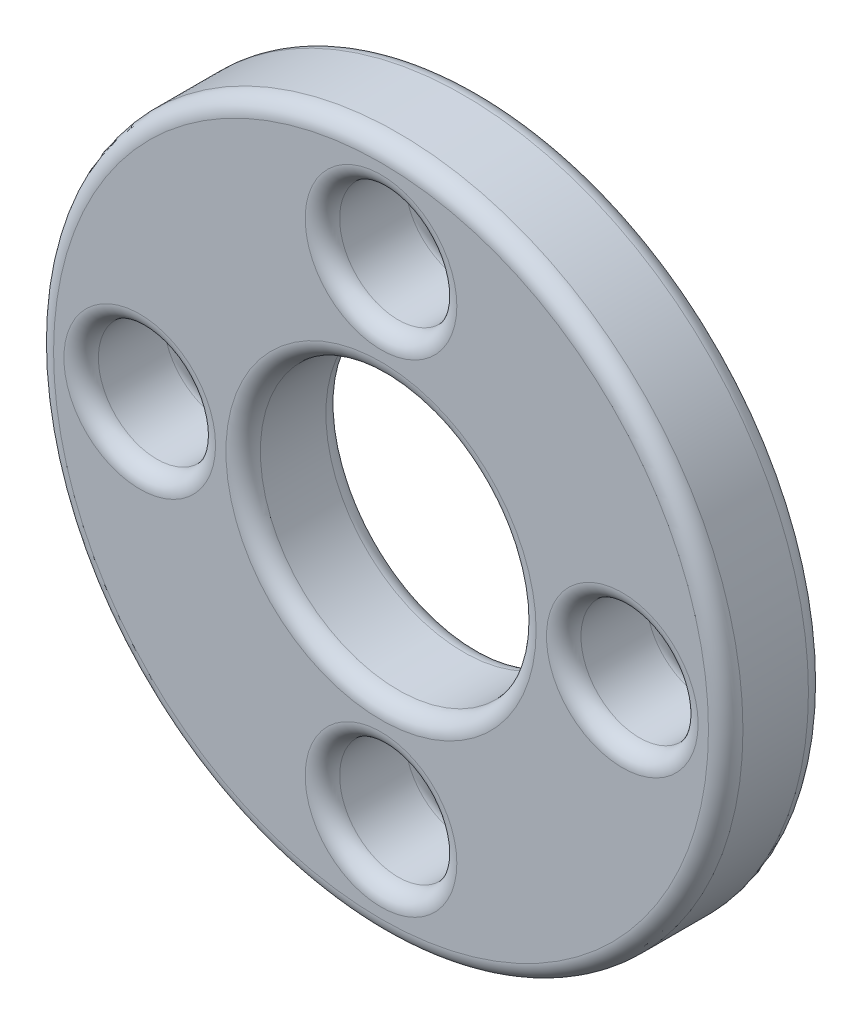
ISO-10303-21;
HEADER;
FILE_DESCRIPTION(('STEP AP214'),'2;1');
FILE_NAME('part.step','',(''),(''),'','','');
FILE_SCHEMA(('AUTOMOTIVE_DESIGN { 1 0 10303 214 1 1 1 1 }'));
ENDSEC;
DATA;
#1=APPLICATION_CONTEXT('core data for automotive mechanical design processes');
#2=APPLICATION_PROTOCOL_DEFINITION('international standard','automotive_design',2000,#1);
#3=PRODUCT_CONTEXT('',#1,'mechanical');
#4=PRODUCT('Part','Part','',(#3));
#5=PRODUCT_RELATED_PRODUCT_CATEGORY('part','',(#4));
#6=PRODUCT_DEFINITION_FORMATION('','',#4);
#7=PRODUCT_DEFINITION_CONTEXT('part definition',#1,'design');
#8=PRODUCT_DEFINITION('design','',#6,#7);
#9=PRODUCT_DEFINITION_SHAPE('','',#8);
#10=(LENGTH_UNIT() NAMED_UNIT(*) SI_UNIT(.MILLI.,.METRE.));
#11=(NAMED_UNIT(*) PLANE_ANGLE_UNIT() SI_UNIT($,.RADIAN.));
#12=(NAMED_UNIT(*) SI_UNIT($,.STERADIAN.) SOLID_ANGLE_UNIT());
#13=UNCERTAINTY_MEASURE_WITH_UNIT(LENGTH_MEASURE(1.E-05),#10,'distance_accuracy_value','');
#14=(GEOMETRIC_REPRESENTATION_CONTEXT(3) GLOBAL_UNCERTAINTY_ASSIGNED_CONTEXT((#13)) GLOBAL_UNIT_ASSIGNED_CONTEXT((#10,
#11,#12)) REPRESENTATION_CONTEXT('',''));
#15=CARTESIAN_POINT('',(0.,0.,0.));
#16=DIRECTION('',(0.,0.,1.));
#17=DIRECTION('',(1.,0.,0.));
#18=AXIS2_PLACEMENT_3D('',#15,#16,#17);
#19=CARTESIAN_POINT('',(0.,0.,2.9));
#20=DIRECTION('',(0.,0.,-1.));
#21=DIRECTION('',(-1.,0.,0.));
#22=AXIS2_PLACEMENT_3D('',#19,#20,#21);
#23=CYLINDRICAL_SURFACE('',#22,10.);
#24=CARTESIAN_POINT('',(0.,0.,0.5));
#25=DIRECTION('',(0.,0.,1.));
#26=DIRECTION('',(1.,0.,0.));
#27=AXIS2_PLACEMENT_3D('',#24,#25,#26);
#28=CIRCLE('',#27,10.);
#29=CARTESIAN_POINT('',(10.,0.,0.5));
#30=VERTEX_POINT('',#29);
#31=EDGE_CURVE('E115',#30,#30,#28,.T.);
#32=ORIENTED_EDGE('',*,*,#31,.T.);
#33=EDGE_LOOP('',(#32));
#34=FACE_BOUND('',#33,.T.);
#35=CARTESIAN_POINT('',(0.,0.,2.4));
#36=DIRECTION('',(0.,0.,1.));
#37=DIRECTION('',(1.,0.,0.));
#38=AXIS2_PLACEMENT_3D('',#35,#36,#37);
#39=CIRCLE('',#38,10.);
#40=CARTESIAN_POINT('',(10.,0.,2.4));
#41=VERTEX_POINT('',#40);
#42=EDGE_CURVE('E118',#41,#41,#39,.F.);
#43=ORIENTED_EDGE('',*,*,#42,.T.);
#44=EDGE_LOOP('',(#43));
#45=FACE_BOUND('',#44,.T.);
#46=ADVANCED_FACE('F41',(#34,#45),#23,.T.);
#47=CARTESIAN_POINT('',(0.,0.,2.9));
#48=DIRECTION('',(0.,0.,1.));
#49=DIRECTION('',(1.,0.,0.));
#50=AXIS2_PLACEMENT_3D('',#47,#48,#49);
#51=PLANE('',#50);
#52=CARTESIAN_POINT('',(0.,0.,2.9));
#53=DIRECTION('',(0.,0.,1.));
#54=DIRECTION('',(1.,0.,0.));
#55=AXIS2_PLACEMENT_3D('',#52,#53,#54);
#56=CIRCLE('',#55,9.5);
#57=CARTESIAN_POINT('',(9.5,0.,2.9));
#58=VERTEX_POINT('',#57);
#59=EDGE_CURVE('E10',#58,#58,#56,.T.);
#60=ORIENTED_EDGE('',*,*,#59,.T.);
#61=EDGE_LOOP('',(#60));
#62=FACE_BOUND('',#61,.T.);
#63=CARTESIAN_POINT('',(7.,0.,2.9));
#64=DIRECTION('',(0.,0.,1.));
#65=DIRECTION('',(1.,0.,0.));
#66=AXIS2_PLACEMENT_3D('',#63,#64,#65);
#67=CIRCLE('',#66,2.2);
#68=CARTESIAN_POINT('',(9.2,0.,2.9));
#69=VERTEX_POINT('',#68);
#70=EDGE_CURVE('E48',#69,#69,#67,.F.);
#71=ORIENTED_EDGE('',*,*,#70,.T.);
#72=EDGE_LOOP('',(#71));
#73=FACE_BOUND('',#72,.T.);
#74=CARTESIAN_POINT('',(0.,-7.,2.9));
#75=DIRECTION('',(0.,0.,1.));
#76=DIRECTION('',(1.,0.,0.));
#77=AXIS2_PLACEMENT_3D('',#74,#75,#76);
#78=CIRCLE('',#77,2.2);
#79=CARTESIAN_POINT('',(2.2,-7.,2.9));
#80=VERTEX_POINT('',#79);
#81=EDGE_CURVE('E52',#80,#80,#78,.F.);
#82=ORIENTED_EDGE('',*,*,#81,.T.);
#83=EDGE_LOOP('',(#82));
#84=FACE_BOUND('',#83,.T.);
#85=CARTESIAN_POINT('',(-7.,0.,2.9));
#86=DIRECTION('',(0.,0.,1.));
#87=DIRECTION('',(1.,0.,0.));
#88=AXIS2_PLACEMENT_3D('',#85,#86,#87);
#89=CIRCLE('',#88,2.2);
#90=CARTESIAN_POINT('',(-4.8,0.,2.9));
#91=VERTEX_POINT('',#90);
#92=EDGE_CURVE('E56',#91,#91,#89,.F.);
#93=ORIENTED_EDGE('',*,*,#92,.T.);
#94=EDGE_LOOP('',(#93));
#95=FACE_BOUND('',#94,.T.);
#96=CARTESIAN_POINT('',(0.,7.,2.9));
#97=DIRECTION('',(0.,0.,1.));
#98=DIRECTION('',(1.,0.,0.));
#99=AXIS2_PLACEMENT_3D('',#96,#97,#98);
#100=CIRCLE('',#99,2.2);
#101=CARTESIAN_POINT('',(2.2,7.,2.9));
#102=VERTEX_POINT('',#101);
#103=EDGE_CURVE('E61',#102,#102,#100,.F.);
#104=ORIENTED_EDGE('',*,*,#103,.T.);
#105=EDGE_LOOP('',(#104));
#106=FACE_BOUND('',#105,.T.);
#107=CARTESIAN_POINT('',(0.,0.,2.9));
#108=DIRECTION('',(0.,0.,1.));
#109=DIRECTION('',(1.,0.,0.));
#110=AXIS2_PLACEMENT_3D('',#107,#108,#109);
#111=CIRCLE('',#110,4.5);
#112=CARTESIAN_POINT('',(4.5,0.,2.9));
#113=VERTEX_POINT('',#112);
#114=EDGE_CURVE('E64',#113,#113,#111,.F.);
#115=ORIENTED_EDGE('',*,*,#114,.T.);
#116=EDGE_LOOP('',(#115));
#117=FACE_BOUND('',#116,.T.);
#118=ADVANCED_FACE('F140',(#62,#73,#84,#95,#106,#117),#51,.T.);
#119=CARTESIAN_POINT('',(0.,0.,0.));
#120=DIRECTION('',(0.,0.,1.));
#121=DIRECTION('',(1.,0.,0.));
#122=AXIS2_PLACEMENT_3D('',#119,#120,#121);
#123=PLANE('',#122);
#124=CARTESIAN_POINT('',(0.,0.,0.));
#125=DIRECTION('',(0.,0.,1.));
#126=DIRECTION('',(1.,0.,0.));
#127=AXIS2_PLACEMENT_3D('',#124,#125,#126);
#128=CIRCLE('',#127,9.5);
#129=CARTESIAN_POINT('',(9.5,0.,0.));
#130=VERTEX_POINT('',#129);
#131=EDGE_CURVE('E97',#130,#130,#128,.F.);
#132=ORIENTED_EDGE('',*,*,#131,.T.);
#133=EDGE_LOOP('',(#132));
#134=FACE_BOUND('',#133,.T.);
#135=CARTESIAN_POINT('',(7.,0.,0.));
#136=DIRECTION('',(0.,0.,1.));
#137=DIRECTION('',(1.,0.,0.));
#138=AXIS2_PLACEMENT_3D('',#135,#136,#137);
#139=CIRCLE('',#138,2.2);
#140=CARTESIAN_POINT('',(9.2,0.,0.));
#141=VERTEX_POINT('',#140);
#142=EDGE_CURVE('E100',#141,#141,#139,.T.);
#143=ORIENTED_EDGE('',*,*,#142,.T.);
#144=EDGE_LOOP('',(#143));
#145=FACE_BOUND('',#144,.T.);
#146=CARTESIAN_POINT('',(0.,-7.,0.));
#147=DIRECTION('',(0.,0.,1.));
#148=DIRECTION('',(1.,0.,0.));
#149=AXIS2_PLACEMENT_3D('',#146,#147,#148);
#150=CIRCLE('',#149,2.2);
#151=CARTESIAN_POINT('',(2.2,-7.,0.));
#152=VERTEX_POINT('',#151);
#153=EDGE_CURVE('E103',#152,#152,#150,.T.);
#154=ORIENTED_EDGE('',*,*,#153,.T.);
#155=EDGE_LOOP('',(#154));
#156=FACE_BOUND('',#155,.T.);
#157=CARTESIAN_POINT('',(-7.,0.,0.));
#158=DIRECTION('',(0.,0.,1.));
#159=DIRECTION('',(1.,0.,0.));
#160=AXIS2_PLACEMENT_3D('',#157,#158,#159);
#161=CIRCLE('',#160,2.2);
#162=CARTESIAN_POINT('',(-4.8,0.,0.));
#163=VERTEX_POINT('',#162);
#164=EDGE_CURVE('E106',#163,#163,#161,.T.);
#165=ORIENTED_EDGE('',*,*,#164,.T.);
#166=EDGE_LOOP('',(#165));
#167=FACE_BOUND('',#166,.T.);
#168=CARTESIAN_POINT('',(0.,7.,0.));
#169=DIRECTION('',(0.,0.,1.));
#170=DIRECTION('',(1.,0.,0.));
#171=AXIS2_PLACEMENT_3D('',#168,#169,#170);
#172=CIRCLE('',#171,2.2);
#173=CARTESIAN_POINT('',(2.2,7.,0.));
#174=VERTEX_POINT('',#173);
#175=EDGE_CURVE('E109',#174,#174,#172,.T.);
#176=ORIENTED_EDGE('',*,*,#175,.T.);
#177=EDGE_LOOP('',(#176));
#178=FACE_BOUND('',#177,.T.);
#179=CARTESIAN_POINT('',(0.,0.,0.));
#180=DIRECTION('',(0.,0.,1.));
#181=DIRECTION('',(1.,0.,0.));
#182=AXIS2_PLACEMENT_3D('',#179,#180,#181);
#183=CIRCLE('',#182,4.5);
#184=CARTESIAN_POINT('',(4.5,0.,0.));
#185=VERTEX_POINT('',#184);
#186=EDGE_CURVE('E112',#185,#185,#183,.T.);
#187=ORIENTED_EDGE('',*,*,#186,.T.);
#188=EDGE_LOOP('',(#187));
#189=FACE_BOUND('',#188,.T.);
#190=ADVANCED_FACE('F146',(#134,#145,#156,#167,#178,#189),#123,.F.);
#191=CARTESIAN_POINT('',(7.,0.,2.9));
#192=DIRECTION('',(0.,0.,1.));
#193=DIRECTION('',(1.,0.,0.));
#194=AXIS2_PLACEMENT_3D('',#191,#192,#193);
#195=CYLINDRICAL_SURFACE('',#194,1.7);
#196=CARTESIAN_POINT('',(7.,0.,0.5));
#197=DIRECTION('',(0.,0.,1.));
#198=DIRECTION('',(1.,0.,0.));
#199=AXIS2_PLACEMENT_3D('',#196,#197,#198);
#200=CIRCLE('',#199,1.7);
#201=CARTESIAN_POINT('',(8.7,0.,0.5));
#202=VERTEX_POINT('',#201);
#203=EDGE_CURVE('E91',#202,#202,#200,.F.);
#204=ORIENTED_EDGE('',*,*,#203,.T.);
#205=EDGE_LOOP('',(#204));
#206=FACE_BOUND('',#205,.T.);
#207=CARTESIAN_POINT('',(7.,0.,2.4));
#208=DIRECTION('',(0.,0.,1.));
#209=DIRECTION('',(1.,0.,0.));
#210=AXIS2_PLACEMENT_3D('',#207,#208,#209);
#211=CIRCLE('',#210,1.7);
#212=CARTESIAN_POINT('',(8.7,0.,2.4));
#213=VERTEX_POINT('',#212);
#214=EDGE_CURVE('E94',#213,#213,#211,.T.);
#215=ORIENTED_EDGE('',*,*,#214,.T.);
#216=EDGE_LOOP('',(#215));
#217=FACE_BOUND('',#216,.T.);
#218=ADVANCED_FACE('F177',(#206,#217),#195,.F.);
#219=CARTESIAN_POINT('',(0.,-7.,2.9));
#220=DIRECTION('',(0.,0.,1.));
#221=DIRECTION('',(1.,0.,0.));
#222=AXIS2_PLACEMENT_3D('',#219,#220,#221);
#223=CYLINDRICAL_SURFACE('',#222,1.7);
#224=CARTESIAN_POINT('',(0.,-7.,0.5));
#225=DIRECTION('',(0.,0.,1.));
#226=DIRECTION('',(1.,0.,0.));
#227=AXIS2_PLACEMENT_3D('',#224,#225,#226);
#228=CIRCLE('',#227,1.7);
#229=CARTESIAN_POINT('',(1.7,-7.,0.5));
#230=VERTEX_POINT('',#229);
#231=EDGE_CURVE('E85',#230,#230,#228,.F.);
#232=ORIENTED_EDGE('',*,*,#231,.T.);
#233=EDGE_LOOP('',(#232));
#234=FACE_BOUND('',#233,.T.);
#235=CARTESIAN_POINT('',(0.,-7.,2.4));
#236=DIRECTION('',(0.,0.,1.));
#237=DIRECTION('',(1.,0.,0.));
#238=AXIS2_PLACEMENT_3D('',#235,#236,#237);
#239=CIRCLE('',#238,1.7);
#240=CARTESIAN_POINT('',(1.7,-7.,2.4));
#241=VERTEX_POINT('',#240);
#242=EDGE_CURVE('E88',#241,#241,#239,.T.);
#243=ORIENTED_EDGE('',*,*,#242,.T.);
#244=EDGE_LOOP('',(#243));
#245=FACE_BOUND('',#244,.T.);
#246=ADVANCED_FACE('F184',(#234,#245),#223,.F.);
#247=CARTESIAN_POINT('',(-7.,0.,2.9));
#248=DIRECTION('',(0.,0.,1.));
#249=DIRECTION('',(1.,0.,0.));
#250=AXIS2_PLACEMENT_3D('',#247,#248,#249);
#251=CYLINDRICAL_SURFACE('',#250,1.7);
#252=CARTESIAN_POINT('',(-7.,0.,0.5));
#253=DIRECTION('',(0.,0.,1.));
#254=DIRECTION('',(1.,0.,0.));
#255=AXIS2_PLACEMENT_3D('',#252,#253,#254);
#256=CIRCLE('',#255,1.7);
#257=CARTESIAN_POINT('',(-5.3,0.,0.5));
#258=VERTEX_POINT('',#257);
#259=EDGE_CURVE('E79',#258,#258,#256,.F.);
#260=ORIENTED_EDGE('',*,*,#259,.T.);
#261=EDGE_LOOP('',(#260));
#262=FACE_BOUND('',#261,.T.);
#263=CARTESIAN_POINT('',(-7.,0.,2.4));
#264=DIRECTION('',(0.,0.,1.));
#265=DIRECTION('',(1.,0.,0.));
#266=AXIS2_PLACEMENT_3D('',#263,#264,#265);
#267=CIRCLE('',#266,1.7);
#268=CARTESIAN_POINT('',(-5.3,0.,2.4));
#269=VERTEX_POINT('',#268);
#270=EDGE_CURVE('E82',#269,#269,#267,.T.);
#271=ORIENTED_EDGE('',*,*,#270,.T.);
#272=EDGE_LOOP('',(#271));
#273=FACE_BOUND('',#272,.T.);
#274=ADVANCED_FACE('F202',(#262,#273),#251,.F.);
#275=CARTESIAN_POINT('',(0.,7.,2.9));
#276=DIRECTION('',(0.,0.,1.));
#277=DIRECTION('',(1.,0.,0.));
#278=AXIS2_PLACEMENT_3D('',#275,#276,#277);
#279=CYLINDRICAL_SURFACE('',#278,1.7);
#280=CARTESIAN_POINT('',(0.,7.,0.5));
#281=DIRECTION('',(0.,0.,1.));
#282=DIRECTION('',(1.,0.,0.));
#283=AXIS2_PLACEMENT_3D('',#280,#281,#282);
#284=CIRCLE('',#283,1.7);
#285=CARTESIAN_POINT('',(1.7,7.,0.5));
#286=VERTEX_POINT('',#285);
#287=EDGE_CURVE('E73',#286,#286,#284,.F.);
#288=ORIENTED_EDGE('',*,*,#287,.T.);
#289=EDGE_LOOP('',(#288));
#290=FACE_BOUND('',#289,.T.);
#291=CARTESIAN_POINT('',(0.,7.,2.4));
#292=DIRECTION('',(0.,0.,1.));
#293=DIRECTION('',(1.,0.,0.));
#294=AXIS2_PLACEMENT_3D('',#291,#292,#293);
#295=CIRCLE('',#294,1.7);
#296=CARTESIAN_POINT('',(1.7,7.,2.4));
#297=VERTEX_POINT('',#296);
#298=EDGE_CURVE('E76',#297,#297,#295,.T.);
#299=ORIENTED_EDGE('',*,*,#298,.T.);
#300=EDGE_LOOP('',(#299));
#301=FACE_BOUND('',#300,.T.);
#302=ADVANCED_FACE('F209',(#290,#301),#279,.F.);
#303=CARTESIAN_POINT('',(0.,0.,0.));
#304=DIRECTION('',(0.,0.,1.));
#305=DIRECTION('',(1.,0.,0.));
#306=AXIS2_PLACEMENT_3D('',#303,#304,#305);
#307=CYLINDRICAL_SURFACE('',#306,4.);
#308=CARTESIAN_POINT('',(0.,0.,0.5));
#309=DIRECTION('',(0.,0.,1.));
#310=DIRECTION('',(1.,0.,0.));
#311=AXIS2_PLACEMENT_3D('',#308,#309,#310);
#312=CIRCLE('',#311,4.);
#313=CARTESIAN_POINT('',(4.,0.,0.5));
#314=VERTEX_POINT('',#313);
#315=EDGE_CURVE('E67',#314,#314,#312,.F.);
#316=ORIENTED_EDGE('',*,*,#315,.T.);
#317=EDGE_LOOP('',(#316));
#318=FACE_BOUND('',#317,.T.);
#319=CARTESIAN_POINT('',(0.,0.,2.4));
#320=DIRECTION('',(0.,0.,1.));
#321=DIRECTION('',(1.,0.,0.));
#322=AXIS2_PLACEMENT_3D('',#319,#320,#321);
#323=CIRCLE('',#322,4.);
#324=CARTESIAN_POINT('',(4.,0.,2.4));
#325=VERTEX_POINT('',#324);
#326=EDGE_CURVE('E70',#325,#325,#323,.T.);
#327=ORIENTED_EDGE('',*,*,#326,.T.);
#328=EDGE_LOOP('',(#327));
#329=FACE_BOUND('',#328,.T.);
#330=ADVANCED_FACE('F154',(#318,#329),#307,.F.);
#331=CARTESIAN_POINT('',(0.,0.,0.5));
#332=DIRECTION('',(0.,0.,1.));
#333=DIRECTION('',(1.,0.,0.));
#334=AXIS2_PLACEMENT_3D('',#331,#332,#333);
#335=TOROIDAL_SURFACE('',#334,9.5,0.5);
#336=ORIENTED_EDGE('',*,*,#131,.F.);
#337=EDGE_LOOP('',(#336));
#338=FACE_BOUND('',#337,.T.);
#339=ORIENTED_EDGE('',*,*,#31,.F.);
#340=EDGE_LOOP('',(#339));
#341=FACE_BOUND('',#340,.T.);
#342=ADVANCED_FACE('F150',(#338,#341),#335,.T.);
#343=CARTESIAN_POINT('',(7.,0.,0.5));
#344=DIRECTION('',(0.,0.,1.));
#345=DIRECTION('',(1.,0.,0.));
#346=AXIS2_PLACEMENT_3D('',#343,#344,#345);
#347=TOROIDAL_SURFACE('',#346,2.2,0.5);
#348=ORIENTED_EDGE('',*,*,#203,.F.);
#349=EDGE_LOOP('',(#348));
#350=FACE_BOUND('',#349,.T.);
#351=ORIENTED_EDGE('',*,*,#142,.F.);
#352=EDGE_LOOP('',(#351));
#353=FACE_BOUND('',#352,.T.);
#354=ADVANCED_FACE('F153',(#350,#353),#347,.T.);
#355=CARTESIAN_POINT('',(0.,-7.,0.5));
#356=DIRECTION('',(0.,0.,1.));
#357=DIRECTION('',(1.,0.,0.));
#358=AXIS2_PLACEMENT_3D('',#355,#356,#357);
#359=TOROIDAL_SURFACE('',#358,2.2,0.5);
#360=ORIENTED_EDGE('',*,*,#231,.F.);
#361=EDGE_LOOP('',(#360));
#362=FACE_BOUND('',#361,.T.);
#363=ORIENTED_EDGE('',*,*,#153,.F.);
#364=EDGE_LOOP('',(#363));
#365=FACE_BOUND('',#364,.T.);
#366=ADVANCED_FACE('F158',(#362,#365),#359,.T.);
#367=CARTESIAN_POINT('',(-7.,0.,0.5));
#368=DIRECTION('',(0.,0.,1.));
#369=DIRECTION('',(1.,0.,0.));
#370=AXIS2_PLACEMENT_3D('',#367,#368,#369);
#371=TOROIDAL_SURFACE('',#370,2.2,0.5);
#372=ORIENTED_EDGE('',*,*,#259,.F.);
#373=EDGE_LOOP('',(#372));
#374=FACE_BOUND('',#373,.T.);
#375=ORIENTED_EDGE('',*,*,#164,.F.);
#376=EDGE_LOOP('',(#375));
#377=FACE_BOUND('',#376,.T.);
#378=ADVANCED_FACE('F162',(#374,#377),#371,.T.);
#379=CARTESIAN_POINT('',(0.,7.,0.5));
#380=DIRECTION('',(0.,0.,1.));
#381=DIRECTION('',(1.,0.,0.));
#382=AXIS2_PLACEMENT_3D('',#379,#380,#381);
#383=TOROIDAL_SURFACE('',#382,2.2,0.5);
#384=ORIENTED_EDGE('',*,*,#287,.F.);
#385=EDGE_LOOP('',(#384));
#386=FACE_BOUND('',#385,.T.);
#387=ORIENTED_EDGE('',*,*,#175,.F.);
#388=EDGE_LOOP('',(#387));
#389=FACE_BOUND('',#388,.T.);
#390=ADVANCED_FACE('F136',(#386,#389),#383,.T.);
#391=CARTESIAN_POINT('',(0.,0.,0.5));
#392=DIRECTION('',(0.,0.,1.));
#393=DIRECTION('',(1.,0.,0.));
#394=AXIS2_PLACEMENT_3D('',#391,#392,#393);
#395=TOROIDAL_SURFACE('',#394,4.5,0.5);
#396=ORIENTED_EDGE('',*,*,#315,.F.);
#397=EDGE_LOOP('',(#396));
#398=FACE_BOUND('',#397,.T.);
#399=ORIENTED_EDGE('',*,*,#186,.F.);
#400=EDGE_LOOP('',(#399));
#401=FACE_BOUND('',#400,.T.);
#402=ADVANCED_FACE('F127',(#398,#401),#395,.T.);
#403=CARTESIAN_POINT('',(0.,0.,2.4));
#404=DIRECTION('',(0.,0.,1.));
#405=DIRECTION('',(1.,0.,0.));
#406=AXIS2_PLACEMENT_3D('',#403,#404,#405);
#407=TOROIDAL_SURFACE('',#406,9.5,0.5);
#408=ORIENTED_EDGE('',*,*,#42,.F.);
#409=EDGE_LOOP('',(#408));
#410=FACE_BOUND('',#409,.T.);
#411=ORIENTED_EDGE('',*,*,#59,.F.);
#412=EDGE_LOOP('',(#411));
#413=FACE_BOUND('',#412,.T.);
#414=ADVANCED_FACE('F123',(#410,#413),#407,.T.);
#415=CARTESIAN_POINT('',(7.,0.,2.4));
#416=DIRECTION('',(0.,0.,1.));
#417=DIRECTION('',(1.,0.,0.));
#418=AXIS2_PLACEMENT_3D('',#415,#416,#417);
#419=TOROIDAL_SURFACE('',#418,2.2,0.5);
#420=ORIENTED_EDGE('',*,*,#70,.F.);
#421=EDGE_LOOP('',(#420));
#422=FACE_BOUND('',#421,.T.);
#423=ORIENTED_EDGE('',*,*,#214,.F.);
#424=EDGE_LOOP('',(#423));
#425=FACE_BOUND('',#424,.T.);
#426=ADVANCED_FACE('F126',(#422,#425),#419,.T.);
#427=CARTESIAN_POINT('',(0.,-7.,2.4));
#428=DIRECTION('',(0.,0.,1.));
#429=DIRECTION('',(1.,0.,0.));
#430=AXIS2_PLACEMENT_3D('',#427,#428,#429);
#431=TOROIDAL_SURFACE('',#430,2.2,0.5);
#432=ORIENTED_EDGE('',*,*,#81,.F.);
#433=EDGE_LOOP('',(#432));
#434=FACE_BOUND('',#433,.T.);
#435=ORIENTED_EDGE('',*,*,#242,.F.);
#436=EDGE_LOOP('',(#435));
#437=FACE_BOUND('',#436,.T.);
#438=ADVANCED_FACE('F133',(#434,#437),#431,.T.);
#439=CARTESIAN_POINT('',(-7.,0.,2.4));
#440=DIRECTION('',(0.,0.,1.));
#441=DIRECTION('',(1.,0.,0.));
#442=AXIS2_PLACEMENT_3D('',#439,#440,#441);
#443=TOROIDAL_SURFACE('',#442,2.2,0.5);
#444=ORIENTED_EDGE('',*,*,#92,.F.);
#445=EDGE_LOOP('',(#444));
#446=FACE_BOUND('',#445,.T.);
#447=ORIENTED_EDGE('',*,*,#270,.F.);
#448=EDGE_LOOP('',(#447));
#449=FACE_BOUND('',#448,.T.);
#450=ADVANCED_FACE('F228',(#446,#449),#443,.T.);
#451=CARTESIAN_POINT('',(0.,7.,2.4));
#452=DIRECTION('',(0.,0.,1.));
#453=DIRECTION('',(1.,0.,0.));
#454=AXIS2_PLACEMENT_3D('',#451,#452,#453);
#455=TOROIDAL_SURFACE('',#454,2.2,0.5);
#456=ORIENTED_EDGE('',*,*,#103,.F.);
#457=EDGE_LOOP('',(#456));
#458=FACE_BOUND('',#457,.T.);
#459=ORIENTED_EDGE('',*,*,#298,.F.);
#460=EDGE_LOOP('',(#459));
#461=FACE_BOUND('',#460,.T.);
#462=ADVANCED_FACE('F223',(#458,#461),#455,.T.);
#463=CARTESIAN_POINT('',(0.,0.,2.4));
#464=DIRECTION('',(0.,0.,1.));
#465=DIRECTION('',(1.,0.,0.));
#466=AXIS2_PLACEMENT_3D('',#463,#464,#465);
#467=TOROIDAL_SURFACE('',#466,4.5,0.5);
#468=ORIENTED_EDGE('',*,*,#114,.F.);
#469=EDGE_LOOP('',(#468));
#470=FACE_BOUND('',#469,.T.);
#471=ORIENTED_EDGE('',*,*,#326,.F.);
#472=EDGE_LOOP('',(#471));
#473=FACE_BOUND('',#472,.T.);
#474=ADVANCED_FACE('F43',(#470,#473),#467,.T.);
#475=CLOSED_SHELL('',(#46,#118,#190,#218,#246,#274,#302,#330,#342,#354,#366,#378,#390,#402,#414,
#426,#438,#450,#462,#474));
#476=MANIFOLD_SOLID_BREP('B2',#475);
#477=ADVANCED_BREP_SHAPE_REPRESENTATION('',(#18,#476),#14);
#478=SHAPE_DEFINITION_REPRESENTATION(#9,#477);
ENDSEC;
END-ISO-10303-21;
